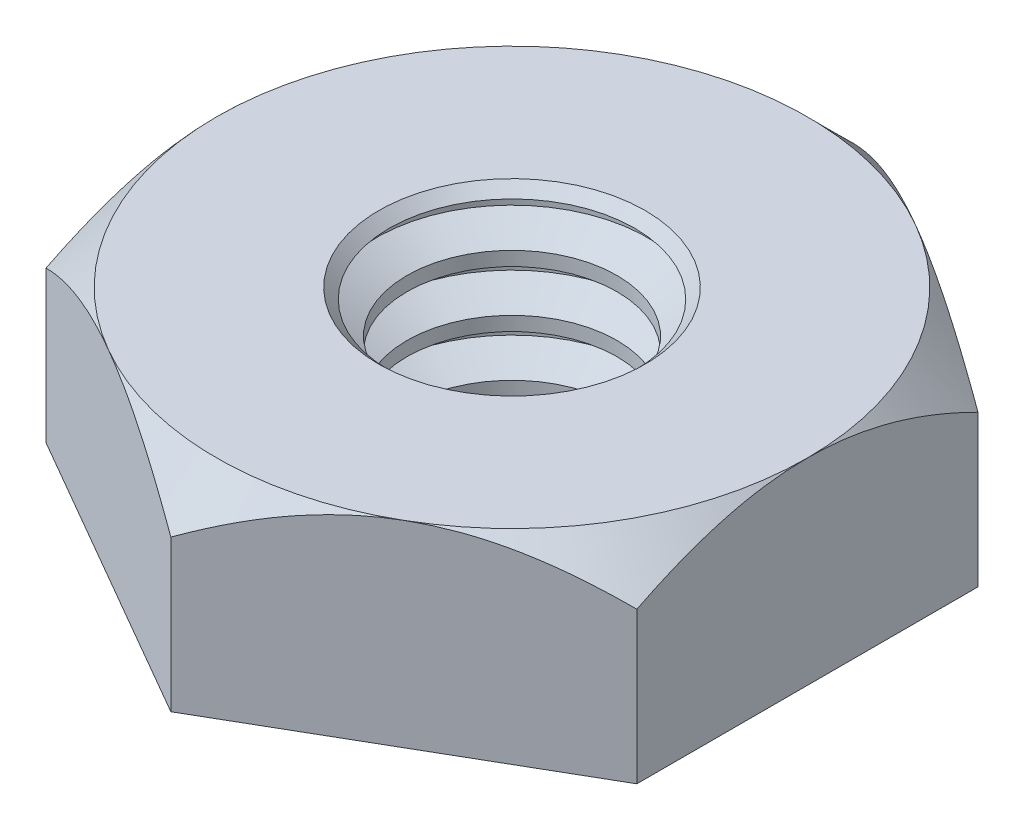
ISO-10303-21;
HEADER;
FILE_DESCRIPTION(('STEP AP214'),'2;1');
FILE_NAME('part.step','',(''),(''),'','','');
FILE_SCHEMA(('AUTOMOTIVE_DESIGN { 1 0 10303 214 1 1 1 1 }'));
ENDSEC;
DATA;
#1=APPLICATION_CONTEXT('core data for automotive mechanical design processes');
#2=APPLICATION_PROTOCOL_DEFINITION('international standard','automotive_design',2000,#1);
#3=PRODUCT_CONTEXT('',#1,'mechanical');
#4=PRODUCT('Part','Part','',(#3));
#5=PRODUCT_RELATED_PRODUCT_CATEGORY('part','',(#4));
#6=PRODUCT_DEFINITION_FORMATION('','',#4);
#7=PRODUCT_DEFINITION_CONTEXT('part definition',#1,'design');
#8=PRODUCT_DEFINITION('design','',#6,#7);
#9=PRODUCT_DEFINITION_SHAPE('','',#8);
#10=(LENGTH_UNIT() NAMED_UNIT(*) SI_UNIT(.MILLI.,.METRE.));
#11=(NAMED_UNIT(*) PLANE_ANGLE_UNIT() SI_UNIT($,.RADIAN.));
#12=(NAMED_UNIT(*) SI_UNIT($,.STERADIAN.) SOLID_ANGLE_UNIT());
#13=UNCERTAINTY_MEASURE_WITH_UNIT(LENGTH_MEASURE(1.E-05),#10,'distance_accuracy_value','');
#14=(GEOMETRIC_REPRESENTATION_CONTEXT(3) GLOBAL_UNCERTAINTY_ASSIGNED_CONTEXT((#13)) GLOBAL_UNIT_ASSIGNED_CONTEXT((#10,
#11,#12)) REPRESENTATION_CONTEXT('',''));
#15=CARTESIAN_POINT('',(0.,0.,0.));
#16=DIRECTION('',(0.,0.,1.));
#17=DIRECTION('',(1.,0.,0.));
#18=AXIS2_PLACEMENT_3D('',#15,#16,#17);
#19=CARTESIAN_POINT('',(0.,0.,-2.74963065701559));
#20=DIRECTION('',(0.,1.,0.));
#21=DIRECTION('',(0.,0.,1.));
#22=AXIS2_PLACEMENT_3D('',#19,#20,#21);
#23=PLANE('',#22);
#24=DIRECTION('',(-0.866025403784439,0.,-0.5));
#25=VECTOR('',#24,1.);
#26=CARTESIAN_POINT('',(2.38125,0.,-1.3748153285078));
#27=LINE('',#26,#25);
#28=CARTESIAN_POINT('',(2.38125,0.,-1.3748153285078));
#29=VERTEX_POINT('',#28);
#30=CARTESIAN_POINT('',(0.,0.,-2.74963065701559));
#31=VERTEX_POINT('',#30);
#32=EDGE_CURVE('E237',#29,#31,#27,.T.);
#33=ORIENTED_EDGE('',*,*,#32,.F.);
#34=DIRECTION('',(0.,0.,-1.));
#35=VECTOR('',#34,1.);
#36=CARTESIAN_POINT('',(2.38125,0.,1.3748153285078));
#37=LINE('',#36,#35);
#38=CARTESIAN_POINT('',(2.38125,0.,1.3748153285078));
#39=VERTEX_POINT('',#38);
#40=EDGE_CURVE('E326',#39,#29,#37,.T.);
#41=ORIENTED_EDGE('',*,*,#40,.F.);
#42=DIRECTION('',(0.866025403784439,0.,-0.5));
#43=VECTOR('',#42,1.);
#44=CARTESIAN_POINT('',(0.,0.,2.74963065701559));
#45=LINE('',#44,#43);
#46=CARTESIAN_POINT('',(0.,0.,2.74963065701559));
#47=VERTEX_POINT('',#46);
#48=EDGE_CURVE('E325',#47,#39,#45,.T.);
#49=ORIENTED_EDGE('',*,*,#48,.F.);
#50=DIRECTION('',(0.866025403784439,0.,0.5));
#51=VECTOR('',#50,1.);
#52=CARTESIAN_POINT('',(-2.38125,0.,1.3748153285078));
#53=LINE('',#52,#51);
#54=CARTESIAN_POINT('',(-2.38125,0.,1.3748153285078));
#55=VERTEX_POINT('',#54);
#56=EDGE_CURVE('E124',#55,#47,#53,.T.);
#57=ORIENTED_EDGE('',*,*,#56,.F.);
#58=DIRECTION('',(0.,0.,1.));
#59=VECTOR('',#58,1.);
#60=CARTESIAN_POINT('',(-2.38125,0.,-1.3748153285078));
#61=LINE('',#60,#59);
#62=CARTESIAN_POINT('',(-2.38125,0.,-1.3748153285078));
#63=VERTEX_POINT('',#62);
#64=EDGE_CURVE('E331',#63,#55,#61,.T.);
#65=ORIENTED_EDGE('',*,*,#64,.F.);
#66=DIRECTION('',(-0.866025403784439,0.,0.5));
#67=VECTOR('',#66,1.);
#68=CARTESIAN_POINT('',(0.,0.,-2.74963065701559));
#69=LINE('',#68,#67);
#70=EDGE_CURVE('E334',#31,#63,#69,.T.);
#71=ORIENTED_EDGE('',*,*,#70,.F.);
#72=EDGE_LOOP('',(#33,#41,#49,#57,#65,#71));
#73=FACE_BOUND('',#72,.T.);
#74=CARTESIAN_POINT('',(0.,0.,0.));
#75=DIRECTION('',(0.,1.,0.));
#76=DIRECTION('',(0.,0.,1.));
#77=AXIS2_PLACEMENT_3D('',#74,#75,#76);
#78=CIRCLE('',#77,1.04309945255329);
#79=CARTESIAN_POINT('',(0.,0.,1.04309945255329));
#80=VERTEX_POINT('',#79);
#81=EDGE_CURVE('E141',#80,#80,#78,.F.);
#82=ORIENTED_EDGE('',*,*,#81,.F.);
#83=EDGE_LOOP('',(#82));
#84=FACE_BOUND('',#83,.T.);
#85=ADVANCED_FACE('F30',(#73,#84),#23,.F.);
#86=CARTESIAN_POINT('',(0.,1.5875,-2.74963065701559));
#87=DIRECTION('',(0.,1.,0.));
#88=DIRECTION('',(0.,0.,1.));
#89=AXIS2_PLACEMENT_3D('',#86,#87,#88);
#90=PLANE('',#89);
#91=CARTESIAN_POINT('',(0.,1.5875,0.));
#92=DIRECTION('',(0.,1.,0.));
#93=DIRECTION('',(0.,0.,1.));
#94=AXIS2_PLACEMENT_3D('',#91,#92,#93);
#95=CIRCLE('',#94,1.07348297705218);
#96=CARTESIAN_POINT('',(0.,1.5875,1.07348297705218));
#97=VERTEX_POINT('',#96);
#98=EDGE_CURVE('E11',#97,#97,#95,.F.);
#99=ORIENTED_EDGE('',*,*,#98,.T.);
#100=EDGE_LOOP('',(#99));
#101=FACE_BOUND('',#100,.T.);
#102=CARTESIAN_POINT('',(0.,1.5875,0.));
#103=DIRECTION('',(0.,1.,0.));
#104=DIRECTION('',(0.,0.,1.));
#105=AXIS2_PLACEMENT_3D('',#102,#103,#104);
#106=CIRCLE('',#105,2.38125);
#107=CARTESIAN_POINT('',(-1.190625,1.5875,2.06222299276169));
#108=VERTEX_POINT('',#107);
#109=CARTESIAN_POINT('',(1.190625,1.5875,2.06222299276169));
#110=VERTEX_POINT('',#109);
#111=EDGE_CURVE('E106',#108,#110,#106,.T.);
#112=ORIENTED_EDGE('',*,*,#111,.T.);
#113=CARTESIAN_POINT('',(0.,1.5875,0.));
#114=DIRECTION('',(0.,1.,0.));
#115=DIRECTION('',(0.,0.,1.));
#116=AXIS2_PLACEMENT_3D('',#113,#114,#115);
#117=CIRCLE('',#116,2.38125);
#118=CARTESIAN_POINT('',(2.38125,1.5875,0.));
#119=VERTEX_POINT('',#118);
#120=EDGE_CURVE('E46',#110,#119,#117,.T.);
#121=ORIENTED_EDGE('',*,*,#120,.T.);
#122=CARTESIAN_POINT('',(1.190625,1.5875,-2.06222299276169));
#123=VERTEX_POINT('',#122);
#124=EDGE_CURVE('E140',#119,#123,#106,.T.);
#125=ORIENTED_EDGE('',*,*,#124,.T.);
#126=CARTESIAN_POINT('',(-1.190625,1.5875,-2.06222299276169));
#127=VERTEX_POINT('',#126);
#128=EDGE_CURVE('E148',#123,#127,#106,.T.);
#129=ORIENTED_EDGE('',*,*,#128,.T.);
#130=CARTESIAN_POINT('',(-2.38125,1.5875,0.));
#131=VERTEX_POINT('',#130);
#132=EDGE_CURVE('E151',#127,#131,#106,.T.);
#133=ORIENTED_EDGE('',*,*,#132,.T.);
#134=EDGE_CURVE('E139',#131,#108,#106,.T.);
#135=ORIENTED_EDGE('',*,*,#134,.T.);
#136=EDGE_LOOP('',(#112,#121,#125,#129,#133,#135));
#137=FACE_BOUND('',#136,.T.);
#138=ADVANCED_FACE('F158',(#101,#137),#90,.T.);
#139=CARTESIAN_POINT('',(2.38125,1.5875,-1.3748153285078));
#140=DIRECTION('',(-0.5,0.,0.866025403784439));
#141=DIRECTION('',(0.866025403784439,0.,0.5));
#142=AXIS2_PLACEMENT_3D('',#139,#140,#141);
#143=PLANE('',#142);
#144=CARTESIAN_POINT('',(2.38145,1.21900386565717,-1.37469985845396));
#145=CARTESIAN_POINT('',(2.29959321762095,1.26622444627488,-1.4219598937955));
#146=CARTESIAN_POINT('',(2.21636766622824,1.31067176769151,-1.47001018829554));
#147=CARTESIAN_POINT('',(2.04666151916196,1.39205388599883,-1.56799007798739));
#148=CARTESIAN_POINT('',(1.9601647826469,1.42894339988927,-1.61792899209838));
#149=CARTESIAN_POINT('',(1.78574822599095,1.4921359298185,-1.71862843803482));
#150=CARTESIAN_POINT('',(1.69787282881932,1.51859778425493,-1.76936332224701));
#151=CARTESIAN_POINT('',(1.52018740592912,1.55936782736835,-1.87195004898374));
#152=CARTESIAN_POINT('',(1.43038280881412,1.57370645145386,-1.92379875730255));
#153=CARTESIAN_POINT('',(1.27561039686965,1.58664355821429,-2.01315665100181));
#154=CARTESIAN_POINT('',(1.21084255103038,1.58855873833123,-2.05055038423195));
#155=CARTESIAN_POINT('',(1.08141272066442,1.58533272021673,-2.12527673163491));
#156=CARTESIAN_POINT('',(1.01675078120663,1.58018904812732,-2.16260931978718));
#157=CARTESIAN_POINT('',(0.888037451422592,1.56313803211277,-2.23692199538629));
#158=CARTESIAN_POINT('',(0.823986825765134,1.55122312163507,-2.27390164135139));
#159=CARTESIAN_POINT('',(0.696993161094713,1.52128367063237,-2.34722146783423));
#160=CARTESIAN_POINT('',(0.634050037564162,1.50325959846595,-2.38356169714823));
#161=CARTESIAN_POINT('',(0.472823849267806,1.44975053543199,-2.47664568036155));
#162=CARTESIAN_POINT('',(0.375540508712151,1.41023192211222,-2.53281224321902));
#163=CARTESIAN_POINT('',(0.232493937374424,1.34351899943361,-2.61540021968751));
#164=CARTESIAN_POINT('',(0.185353711056031,1.32007913387307,-2.6426166420421));
#165=CARTESIAN_POINT('',(0.0919464736333593,1.27106266632487,-2.69654533571234));
#166=CARTESIAN_POINT('',(0.045678947503177,1.24548737621756,-2.72325790437834));
#167=CARTESIAN_POINT('',(-0.000200000000000699,1.21900386565717,-2.74974612706943));
#168=B_SPLINE_CURVE_WITH_KNOTS('',3,(#144,#145,#146,#147,#148,#149,#150,#151,#152,#153,#154,
#155,#156,#157,#158,#159,#160,#161,#162,#163,#164,#165,#166,#167),.UNSPECIFIED.,.F.,.F.,(4,2,2,
2,2,2,2,2,2,2,2,4),(0.,0.317196610611951,0.636241461041222,0.950218950629226,1.26340583824127,
1.48752413747845,1.71172100167748,1.93616888974083,2.16059957440838,2.51709639744764,
2.69486147369099,2.87251813383154),.UNSPECIFIED.);
#169=CARTESIAN_POINT('',(2.38125,1.21911934298441,-1.3748153285078));
#170=VERTEX_POINT('',#169);
#171=EDGE_CURVE('E336',#170,#123,#168,.T.);
#172=ORIENTED_EDGE('',*,*,#171,.F.);
#173=DIRECTION('',(0.,-1.,0.));
#174=VECTOR('',#173,1.);
#175=CARTESIAN_POINT('',(2.38125,1.5875,-1.3748153285078));
#176=LINE('',#175,#174);
#177=EDGE_CURVE('E131',#170,#29,#176,.T.);
#178=ORIENTED_EDGE('',*,*,#177,.T.);
#179=ORIENTED_EDGE('',*,*,#32,.T.);
#180=DIRECTION('',(0.,-1.,0.));
#181=VECTOR('',#180,1.);
#182=CARTESIAN_POINT('',(0.,1.5875,-2.74963065701559));
#183=LINE('',#182,#181);
#184=CARTESIAN_POINT('',(0.,1.21911934298441,-2.74963065701559));
#185=VERTEX_POINT('',#184);
#186=EDGE_CURVE('E136',#185,#31,#183,.T.);
#187=ORIENTED_EDGE('',*,*,#186,.F.);
#188=EDGE_CURVE('E209',#123,#185,#168,.T.);
#189=ORIENTED_EDGE('',*,*,#188,.F.);
#190=EDGE_LOOP('',(#172,#178,#179,#187,#189));
#191=FACE_BOUND('',#190,.T.);
#192=ADVANCED_FACE('F32',(#191),#143,.F.);
#193=CARTESIAN_POINT('',(0.,1.5875,-2.74963065701559));
#194=DIRECTION('',(0.5,0.,0.866025403784439));
#195=DIRECTION('',(0.866025403784439,0.,-0.5));
#196=AXIS2_PLACEMENT_3D('',#193,#194,#195);
#197=PLANE('',#196);
#198=CARTESIAN_POINT('',(0.000199999999999588,1.21900386565717,-2.74974612706943));
#199=CARTESIAN_POINT('',(-0.0816567823790513,1.26622444627487,-2.70248609172789));
#200=CARTESIAN_POINT('',(-0.164882333771762,1.31067176769151,-2.65443579722785));
#201=CARTESIAN_POINT('',(-0.334588480838042,1.39205388599883,-2.556455907536));
#202=CARTESIAN_POINT('',(-0.421085217353105,1.42894339988927,-2.50651699342501));
#203=CARTESIAN_POINT('',(-0.595501774009046,1.4921359298185,-2.40581754748857));
#204=CARTESIAN_POINT('',(-0.683377171180679,1.51859778425493,-2.35508266327638));
#205=CARTESIAN_POINT('',(-0.861062594070881,1.55936782736835,-2.25249593653965));
#206=CARTESIAN_POINT('',(-0.950867191185877,1.57370645145386,-2.20064722822084));
#207=CARTESIAN_POINT('',(-1.10563960313035,1.58664355821429,-2.11128933452158));
#208=CARTESIAN_POINT('',(-1.17040744896963,1.58855873833123,-2.07389560129144));
#209=CARTESIAN_POINT('',(-1.29983727933558,1.58533272021672,-1.99916925388848));
#210=CARTESIAN_POINT('',(-1.36449921879337,1.58018904812732,-1.96183666573621));
#211=CARTESIAN_POINT('',(-1.49321254857741,1.56313803211277,-1.8875239901371));
#212=CARTESIAN_POINT('',(-1.55726317423487,1.55122312163507,-1.850544344172));
#213=CARTESIAN_POINT('',(-1.68425683890529,1.52128367063237,-1.77722451768916));
#214=CARTESIAN_POINT('',(-1.74719996243584,1.50325959846595,-1.74088428837516));
#215=CARTESIAN_POINT('',(-1.90842615073219,1.44975053543199,-1.64780030516184));
#216=CARTESIAN_POINT('',(-2.00570949128785,1.41023192211222,-1.59163374230437));
#217=CARTESIAN_POINT('',(-2.14875606262558,1.34351899943361,-1.50904576583588));
#218=CARTESIAN_POINT('',(-2.19589628894397,1.32007913387307,-1.48182934348129));
#219=CARTESIAN_POINT('',(-2.28930352636664,1.27106266632487,-1.42790064981105));
#220=CARTESIAN_POINT('',(-2.33557105249682,1.24548737621756,-1.40118808114506));
#221=CARTESIAN_POINT('',(-2.38145,1.21900386565717,-1.37469985845396));
#222=B_SPLINE_CURVE_WITH_KNOTS('',3,(#198,#199,#200,#201,#202,#203,#204,#205,#206,#207,#208,
#209,#210,#211,#212,#213,#214,#215,#216,#217,#218,#219,#220,#221),.UNSPECIFIED.,.F.,.F.,(4,2,2,
2,2,2,2,2,2,2,2,4),(0.,0.31719661061195,0.636241461041221,0.950218950629226,1.26340583824127,
1.48752413747845,1.71172100167748,1.93616888974083,2.16059957440838,2.51709639744763,
2.69486147369099,2.87251813383154),.UNSPECIFIED.);
#223=EDGE_CURVE('E208',#185,#127,#222,.T.);
#224=ORIENTED_EDGE('',*,*,#223,.F.);
#225=ORIENTED_EDGE('',*,*,#186,.T.);
#226=ORIENTED_EDGE('',*,*,#70,.T.);
#227=DIRECTION('',(0.,-1.,0.));
#228=VECTOR('',#227,1.);
#229=CARTESIAN_POINT('',(-2.38125,1.5875,-1.3748153285078));
#230=LINE('',#229,#228);
#231=CARTESIAN_POINT('',(-2.38125,1.21911934298441,-1.3748153285078));
#232=VERTEX_POINT('',#231);
#233=EDGE_CURVE('E129',#232,#63,#230,.T.);
#234=ORIENTED_EDGE('',*,*,#233,.F.);
#235=EDGE_CURVE('E204',#127,#232,#222,.T.);
#236=ORIENTED_EDGE('',*,*,#235,.F.);
#237=EDGE_LOOP('',(#224,#225,#226,#234,#236));
#238=FACE_BOUND('',#237,.T.);
#239=ADVANCED_FACE('F214',(#238),#197,.F.);
#240=CARTESIAN_POINT('',(-2.38125,1.5875,-1.3748153285078));
#241=DIRECTION('',(1.,0.,0.));
#242=DIRECTION('',(0.,0.,-1.));
#243=AXIS2_PLACEMENT_3D('',#240,#241,#242);
#244=PLANE('',#243);
#245=CARTESIAN_POINT('',(-2.38125,0.240179588906191,-2.86912630394418));
#246=CARTESIAN_POINT('',(-2.38125,0.29350668912669,-2.79980955592459));
#247=CARTESIAN_POINT('',(-2.38125,0.346355938633454,-2.73011931645309));
#248=CARTESIAN_POINT('',(-2.38125,0.45088042407572,-2.5898391961498));
#249=CARTESIAN_POINT('',(-2.38125,0.502555379296205,-2.519249106375));
#250=CARTESIAN_POINT('',(-2.38125,0.604880705975397,-2.37650077502421));
#251=CARTESIAN_POINT('',(-2.38125,0.655520097364179,-2.30433463685782));
#252=CARTESIAN_POINT('',(-2.38125,0.755036614291819,-2.15880130547658));
#253=CARTESIAN_POINT('',(-2.38125,0.803913861173318,-2.08543419546941));
#254=CARTESIAN_POINT('',(-2.38125,0.902542961805662,-1.93258845780626));
#255=CARTESIAN_POINT('',(-2.38125,0.952152910200811,-1.85301779850508));
#256=CARTESIAN_POINT('',(-2.38125,1.04827866709485,-1.69203159559178));
#257=CARTESIAN_POINT('',(-2.38125,1.09479487864361,-1.61061629415845));
#258=CARTESIAN_POINT('',(-2.38125,1.18376557525143,-1.44588343133112));
#259=CARTESIAN_POINT('',(-2.38125,1.22623141970181,-1.36257205340724));
#260=CARTESIAN_POINT('',(-2.38125,1.30614212570997,-1.19359416640858));
#261=CARTESIAN_POINT('',(-2.38125,1.34358935588908,-1.10792879151244));
#262=CARTESIAN_POINT('',(-2.38125,1.40872452306873,-0.942635039086761));
#263=CARTESIAN_POINT('',(-2.38125,1.43701080014171,-0.863244863476224));
#264=CARTESIAN_POINT('',(-2.38125,1.48722865765993,-0.702441892782961));
#265=CARTESIAN_POINT('',(-2.38125,1.50915983334739,-0.621028969229361));
#266=CARTESIAN_POINT('',(-2.38125,1.54511481952273,-0.458084644425683));
#267=CARTESIAN_POINT('',(-2.38125,1.55928224783569,-0.376585475437999));
#268=CARTESIAN_POINT('',(-2.38125,1.57941416514849,-0.212574622282759));
#269=CARTESIAN_POINT('',(-2.38125,1.5853803560254,-0.130063151769297));
#270=CARTESIAN_POINT('',(-2.38125,1.58860164225672,0.0315222598582071));
#271=CARTESIAN_POINT('',(-2.38125,1.58622590278112,0.110588903174691));
#272=CARTESIAN_POINT('',(-2.38125,1.5737417806567,0.268104622589962));
#273=CARTESIAN_POINT('',(-2.38125,1.56363269564102,0.346553641940322));
#274=CARTESIAN_POINT('',(-2.38125,1.53608239112472,0.503598587723649));
#275=CARTESIAN_POINT('',(-2.38125,1.51851172190117,0.582171453187213));
#276=CARTESIAN_POINT('',(-2.38125,1.47701024838173,0.737578750449081));
#277=CARTESIAN_POINT('',(-2.38125,1.45307980531335,0.814413280713858));
#278=CARTESIAN_POINT('',(-2.38125,1.37028997046201,1.05086897592276));
#279=CARTESIAN_POINT('',(-2.38125,1.30223450438981,1.20728049738153));
#280=CARTESIAN_POINT('',(-2.38125,1.18870821735986,1.43619844948697));
#281=CARTESIAN_POINT('',(-2.38125,1.14887086566416,1.51169480576284));
#282=CARTESIAN_POINT('',(-2.38125,1.0661066438325,1.6609787360797));
#283=CARTESIAN_POINT('',(-2.38125,1.02318031702828,1.73476660762932));
#284=CARTESIAN_POINT('',(-2.38125,0.937038433864164,1.87722638325708));
#285=CARTESIAN_POINT('',(-2.38125,0.893941790031279,1.94597101003489));
#286=CARTESIAN_POINT('',(-2.38125,0.805912978151156,2.08228069367818));
#287=CARTESIAN_POINT('',(-2.38125,0.760980672486614,2.14984566156212));
#288=CARTESIAN_POINT('',(-2.38125,0.669974823916357,2.2834054266231));
#289=CARTESIAN_POINT('',(-2.38125,0.623913340345271,2.34940847508033));
#290=CARTESIAN_POINT('',(-2.38125,0.530555625753051,2.48050909903297));
#291=CARTESIAN_POINT('',(-2.38125,0.483259738608899,2.54560691911997));
#292=CARTESIAN_POINT('',(-2.38125,0.43545844514295,2.61032519987917));
#293=B_SPLINE_CURVE_WITH_KNOTS('',3,(#245,#246,#247,#248,#249,#250,#251,#252,#253,#254,#255,
#256,#257,#258,#259,#260,#261,#262,#263,#264,#265,#266,#267,#268,#269,#270,#271,#272,#273,#274,
#275,#276,#277,#278,#279,#280,#281,#282,#283,#284,#285,#286,#287,#288,#289,#290,#291,#292),
.UNSPECIFIED.,.F.,.F.,(4,2,2,2,2,2,2,2,2,2,2,2,2,2,2,2,2,2,2,2,2,2,2,4),(0.,0.262373486076588,
0.524809046422165,0.789269246638216,1.05371120100017,1.33496294182564,1.61617796930575,
1.89657958024649,2.17684838122957,2.42946682102385,2.68210134660698,2.92988953986811,
3.1776263056777,3.41454048769347,3.65147618955808,3.89270212574337,4.13391436351257,
4.64406226241703,4.90012722407797,5.15614725506487,5.3995273075234,5.64292563948721,
5.88436975409122,6.12574731099198),.UNSPECIFIED.);
#294=EDGE_CURVE('E163',#232,#131,#293,.T.);
#295=ORIENTED_EDGE('',*,*,#294,.F.);
#296=ORIENTED_EDGE('',*,*,#233,.T.);
#297=ORIENTED_EDGE('',*,*,#64,.T.);
#298=DIRECTION('',(0.,-1.,0.));
#299=VECTOR('',#298,1.);
#300=CARTESIAN_POINT('',(-2.38125,1.5875,1.3748153285078));
#301=LINE('',#300,#299);
#302=CARTESIAN_POINT('',(-2.38125,1.21911934298441,1.3748153285078));
#303=VERTEX_POINT('',#302);
#304=EDGE_CURVE('E126',#303,#55,#301,.T.);
#305=ORIENTED_EDGE('',*,*,#304,.F.);
#306=EDGE_CURVE('E161',#131,#303,#293,.T.);
#307=ORIENTED_EDGE('',*,*,#306,.F.);
#308=EDGE_LOOP('',(#295,#296,#297,#305,#307));
#309=FACE_BOUND('',#308,.T.);
#310=ADVANCED_FACE('F217',(#309),#244,.F.);
#311=CARTESIAN_POINT('',(-2.38125,1.5875,1.3748153285078));
#312=DIRECTION('',(0.5,0.,-0.866025403784439));
#313=DIRECTION('',(-0.866025403784439,0.,-0.5));
#314=AXIS2_PLACEMENT_3D('',#311,#312,#313);
#315=PLANE('',#314);
#316=CARTESIAN_POINT('',(-2.38145,1.21900386565718,1.37469985845396));
#317=CARTESIAN_POINT('',(-2.29959321762095,1.26622444627488,1.4219598937955));
#318=CARTESIAN_POINT('',(-2.21636766622824,1.31067176769151,1.47001018829554));
#319=CARTESIAN_POINT('',(-2.04666151916196,1.39205388599883,1.56799007798739));
#320=CARTESIAN_POINT('',(-1.96016478264689,1.42894339988927,1.61792899209838));
#321=CARTESIAN_POINT('',(-1.78574822599095,1.4921359298185,1.71862843803482));
#322=CARTESIAN_POINT('',(-1.69787282881932,1.51859778425493,1.76936332224701));
#323=CARTESIAN_POINT('',(-1.52018740592912,1.55936782736835,1.87195004898374));
#324=CARTESIAN_POINT('',(-1.43038280881412,1.57370645145386,1.92379875730254));
#325=CARTESIAN_POINT('',(-1.27561039686965,1.58664355821429,2.01315665100181));
#326=CARTESIAN_POINT('',(-1.21084255103037,1.58855873833123,2.05055038423195));
#327=CARTESIAN_POINT('',(-1.08141272066442,1.58533272021672,2.12527673163491));
#328=CARTESIAN_POINT('',(-1.01675078120663,1.58018904812732,2.16260931978718));
#329=CARTESIAN_POINT('',(-0.888037451422592,1.56313803211277,2.23692199538629));
#330=CARTESIAN_POINT('',(-0.823986825765134,1.55122312163507,2.27390164135139));
#331=CARTESIAN_POINT('',(-0.696993161094713,1.52128367063237,2.34722146783423));
#332=CARTESIAN_POINT('',(-0.634050037564162,1.50325959846595,2.38356169714823));
#333=CARTESIAN_POINT('',(-0.472823849267806,1.449750535432,2.47664568036155));
#334=CARTESIAN_POINT('',(-0.375540508712151,1.41023192211223,2.53281224321902));
#335=CARTESIAN_POINT('',(-0.232493937374424,1.34351899943361,2.61540021968751));
#336=CARTESIAN_POINT('',(-0.185353711056031,1.32007913387307,2.6426166420421));
#337=CARTESIAN_POINT('',(-0.0919464736333589,1.27106266632487,2.69654533571234));
#338=CARTESIAN_POINT('',(-0.0456789475031766,1.24548737621756,2.72325790437833));
#339=CARTESIAN_POINT('',(0.000200000000000871,1.21900386565717,2.74974612706943));
#340=B_SPLINE_CURVE_WITH_KNOTS('',3,(#316,#317,#318,#319,#320,#321,#322,#323,#324,#325,#326,
#327,#328,#329,#330,#331,#332,#333,#334,#335,#336,#337,#338,#339),.UNSPECIFIED.,.F.,.F.,(4,2,2,
2,2,2,2,2,2,2,2,4),(0.,0.31719661061195,0.636241461041222,0.950218950629227,1.26340583824127,
1.48752413747845,1.71172100167748,1.93616888974083,2.16059957440838,2.51709639744763,
2.69486147369099,2.87251813383154),.UNSPECIFIED.);
#341=EDGE_CURVE('E111',#303,#108,#340,.T.);
#342=ORIENTED_EDGE('',*,*,#341,.F.);
#343=ORIENTED_EDGE('',*,*,#304,.T.);
#344=ORIENTED_EDGE('',*,*,#56,.T.);
#345=DIRECTION('',(0.,-1.,0.));
#346=VECTOR('',#345,1.);
#347=CARTESIAN_POINT('',(0.,1.5875,2.74963065701559));
#348=LINE('',#347,#346);
#349=CARTESIAN_POINT('',(0.,1.21911934298441,2.74963065701559));
#350=VERTEX_POINT('',#349);
#351=EDGE_CURVE('E117',#350,#47,#348,.T.);
#352=ORIENTED_EDGE('',*,*,#351,.F.);
#353=EDGE_CURVE('E102',#108,#350,#340,.T.);
#354=ORIENTED_EDGE('',*,*,#353,.F.);
#355=EDGE_LOOP('',(#342,#343,#344,#352,#354));
#356=FACE_BOUND('',#355,.T.);
#357=ADVANCED_FACE('F122',(#356),#315,.F.);
#358=CARTESIAN_POINT('',(0.,1.5875,2.74963065701559));
#359=DIRECTION('',(-0.5,0.,-0.866025403784439));
#360=DIRECTION('',(-0.866025403784439,0.,0.5));
#361=AXIS2_PLACEMENT_3D('',#358,#359,#360);
#362=PLANE('',#361);
#363=CARTESIAN_POINT('',(-0.00019999999999946,1.21900386565717,2.74974612706943));
#364=CARTESIAN_POINT('',(0.0816567823790512,1.26622444627487,2.70248609172789));
#365=CARTESIAN_POINT('',(0.164882333771762,1.31067176769151,2.65443579722785));
#366=CARTESIAN_POINT('',(0.334588480838042,1.39205388599883,2.556455907536));
#367=CARTESIAN_POINT('',(0.421085217353105,1.42894339988927,2.50651699342501));
#368=CARTESIAN_POINT('',(0.595501774009046,1.4921359298185,2.40581754748857));
#369=CARTESIAN_POINT('',(0.683377171180679,1.51859778425493,2.35508266327638));
#370=CARTESIAN_POINT('',(0.86106259407088,1.55936782736835,2.25249593653965));
#371=CARTESIAN_POINT('',(0.950867191185876,1.57370645145386,2.20064722822084));
#372=CARTESIAN_POINT('',(1.10563960313035,1.58664355821429,2.11128933452158));
#373=CARTESIAN_POINT('',(1.17040744896962,1.58855873833122,2.07389560129144));
#374=CARTESIAN_POINT('',(1.29983727933558,1.58533272021672,1.99916925388848));
#375=CARTESIAN_POINT('',(1.36449921879337,1.58018904812732,1.96183666573621));
#376=CARTESIAN_POINT('',(1.49321254857741,1.56313803211277,1.8875239901371));
#377=CARTESIAN_POINT('',(1.55726317423487,1.55122312163507,1.850544344172));
#378=CARTESIAN_POINT('',(1.68425683890529,1.52128367063237,1.77722451768916));
#379=CARTESIAN_POINT('',(1.74719996243584,1.50325959846595,1.74088428837516));
#380=CARTESIAN_POINT('',(1.90842615073219,1.44975053543199,1.64780030516184));
#381=CARTESIAN_POINT('',(2.00570949128785,1.41023192211222,1.59163374230437));
#382=CARTESIAN_POINT('',(2.14875606262558,1.34351899943361,1.50904576583588));
#383=CARTESIAN_POINT('',(2.19589628894397,1.32007913387307,1.48182934348129));
#384=CARTESIAN_POINT('',(2.28930352636664,1.27106266632487,1.42790064981105));
#385=CARTESIAN_POINT('',(2.33557105249682,1.24548737621756,1.40118808114505));
#386=CARTESIAN_POINT('',(2.38145,1.21900386565717,1.37469985845396));
#387=B_SPLINE_CURVE_WITH_KNOTS('',3,(#363,#364,#365,#366,#367,#368,#369,#370,#371,#372,#373,
#374,#375,#376,#377,#378,#379,#380,#381,#382,#383,#384,#385,#386),.UNSPECIFIED.,.F.,.F.,(4,2,2,
2,2,2,2,2,2,2,2,4),(0.,0.31719661061195,0.63624146104122,0.950218950629225,1.26340583824126,
1.48752413747845,1.71172100167748,1.93616888974083,2.16059957440838,2.51709639744763,
2.69486147369099,2.87251813383154),.UNSPECIFIED.);
#388=EDGE_CURVE('E105',#350,#110,#387,.T.);
#389=ORIENTED_EDGE('',*,*,#388,.F.);
#390=ORIENTED_EDGE('',*,*,#351,.T.);
#391=ORIENTED_EDGE('',*,*,#48,.T.);
#392=DIRECTION('',(0.,-1.,0.));
#393=VECTOR('',#392,1.);
#394=CARTESIAN_POINT('',(2.38125,1.5875,1.3748153285078));
#395=LINE('',#394,#393);
#396=CARTESIAN_POINT('',(2.38125,1.21911934298441,1.3748153285078));
#397=VERTEX_POINT('',#396);
#398=EDGE_CURVE('E127',#397,#39,#395,.T.);
#399=ORIENTED_EDGE('',*,*,#398,.F.);
#400=EDGE_CURVE('E120',#110,#397,#387,.T.);
#401=ORIENTED_EDGE('',*,*,#400,.F.);
#402=EDGE_LOOP('',(#389,#390,#391,#399,#401));
#403=FACE_BOUND('',#402,.T.);
#404=ADVANCED_FACE('F115',(#403),#362,.F.);
#405=CARTESIAN_POINT('',(2.38125,1.5875,1.3748153285078));
#406=DIRECTION('',(-1.,0.,0.));
#407=DIRECTION('',(0.,0.,1.));
#408=AXIS2_PLACEMENT_3D('',#405,#406,#407);
#409=PLANE('',#408);
#410=CARTESIAN_POINT('',(2.38125,0.240179588902674,-2.86912630394875));
#411=CARTESIAN_POINT('',(2.38125,0.29350668912328,-2.79980955592907));
#412=CARTESIAN_POINT('',(2.38125,0.346355938630151,-2.73011931645747));
#413=CARTESIAN_POINT('',(2.38125,0.450880424072634,-2.589839196154));
#414=CARTESIAN_POINT('',(2.38125,0.502555379293228,-2.5192491063791));
#415=CARTESIAN_POINT('',(2.38125,0.604880705972639,-2.37650077502812));
#416=CARTESIAN_POINT('',(2.38125,0.65552009736153,-2.30433463686163));
#417=CARTESIAN_POINT('',(2.38125,0.755036614289391,-2.15880130548019));
#418=CARTESIAN_POINT('',(2.38125,0.803913861171,-2.08543419547292));
#419=CARTESIAN_POINT('',(2.38125,0.902542961803583,-1.93258845780956));
#420=CARTESIAN_POINT('',(2.38125,0.95215291019886,-1.85301779850826));
#421=CARTESIAN_POINT('',(2.38125,1.04827866709316,-1.69203159559471));
#422=CARTESIAN_POINT('',(2.38125,1.09479487864204,-1.61061629416126));
#423=CARTESIAN_POINT('',(2.38125,1.18376557525011,-1.44588343133367));
#424=CARTESIAN_POINT('',(2.38125,1.22623141970061,-1.36257205340966));
#425=CARTESIAN_POINT('',(2.38125,1.306142125709,-1.19359416641074));
#426=CARTESIAN_POINT('',(2.38125,1.34358935588823,-1.10792879151447));
#427=CARTESIAN_POINT('',(2.38125,1.40872452306806,-0.942635039088584));
#428=CARTESIAN_POINT('',(2.38125,1.43701080014111,-0.863244863477981));
#429=CARTESIAN_POINT('',(2.38125,1.48722865765948,-0.702441892784583));
#430=CARTESIAN_POINT('',(2.38125,1.509159833347,-0.621028969230913));
#431=CARTESIAN_POINT('',(2.38125,1.54511481952247,-0.458084644427093));
#432=CARTESIAN_POINT('',(2.38125,1.55928224783549,-0.376585475439337));
#433=CARTESIAN_POINT('',(2.38125,1.57941416514839,-0.212574622283949));
#434=CARTESIAN_POINT('',(2.38125,1.58538035602535,-0.13006315177041));
#435=CARTESIAN_POINT('',(2.38125,1.58860164225673,0.0315222598572311));
#436=CARTESIAN_POINT('',(2.38125,1.58622590278117,0.110588903173773));
#437=CARTESIAN_POINT('',(2.38125,1.57374178065679,0.268104622589163));
#438=CARTESIAN_POINT('',(2.38125,1.56363269564113,0.346553641939584));
#439=CARTESIAN_POINT('',(2.38125,1.53608239112485,0.503598587723034));
#440=CARTESIAN_POINT('',(2.38125,1.5185117219013,0.58217145318666));
#441=CARTESIAN_POINT('',(2.38125,1.47701024838186,0.737578750448652));
#442=CARTESIAN_POINT('',(2.38125,1.45307980531348,0.814413280713489));
#443=CARTESIAN_POINT('',(2.38125,1.37028997046216,1.05086897592239));
#444=CARTESIAN_POINT('',(2.38125,1.30223450439,1.20728049738111));
#445=CARTESIAN_POINT('',(2.38125,1.18870821736013,1.43619844948646));
#446=CARTESIAN_POINT('',(2.38125,1.14887086566444,1.51169480576231));
#447=CARTESIAN_POINT('',(2.38125,1.06610664383284,1.66097873607911));
#448=CARTESIAN_POINT('',(2.38125,1.02318031702864,1.73476660762871));
#449=CARTESIAN_POINT('',(2.38125,0.937038433864573,1.87722638325642));
#450=CARTESIAN_POINT('',(2.38125,0.893941790031711,1.94597101003421));
#451=CARTESIAN_POINT('',(2.38125,0.805912978151634,2.08228069367746));
#452=CARTESIAN_POINT('',(2.38125,0.760980672487116,2.14984566156137));
#453=CARTESIAN_POINT('',(2.38125,0.669974823916905,2.28340542662231));
#454=CARTESIAN_POINT('',(2.38125,0.623913340345843,2.34940847507952));
#455=CARTESIAN_POINT('',(2.38125,0.530555625753669,2.48050909903211));
#456=CARTESIAN_POINT('',(2.38125,0.483259738609541,2.54560691911909));
#457=CARTESIAN_POINT('',(2.38125,0.435458445143615,2.61032519987827));
#458=B_SPLINE_CURVE_WITH_KNOTS('',3,(#410,#411,#412,#413,#414,#415,#416,#417,#418,#419,#420,
#421,#422,#423,#424,#425,#426,#427,#428,#429,#430,#431,#432,#433,#434,#435,#436,#437,#438,#439,
#440,#441,#442,#443,#444,#445,#446,#447,#448,#449,#450,#451,#452,#453,#454,#455,#456,#457),
.UNSPECIFIED.,.F.,.F.,(4,2,2,2,2,2,2,2,2,2,2,2,2,2,2,2,2,2,2,2,2,2,2,4),(0.,0.26237348607701,
0.52480904642301,0.789269246639487,1.05371120100187,1.33496294182785,1.61617796930847,
1.89657958024972,2.17684838123331,2.42946682102785,2.68210134661124,2.92988953987261,
3.17762630568243,3.41454048769837,3.65147618956316,3.89270212574863,4.13391436351801,
4.64406226242227,4.9001272240831,5.1561472550699,5.39952730752833,5.64292563949204,
5.88436975409596,6.12574731099663),.UNSPECIFIED.);
#459=EDGE_CURVE('E317',#397,#119,#458,.F.);
#460=ORIENTED_EDGE('',*,*,#459,.F.);
#461=ORIENTED_EDGE('',*,*,#398,.T.);
#462=ORIENTED_EDGE('',*,*,#40,.T.);
#463=ORIENTED_EDGE('',*,*,#177,.F.);
#464=EDGE_CURVE('E194',#119,#170,#458,.F.);
#465=ORIENTED_EDGE('',*,*,#464,.F.);
#466=EDGE_LOOP('',(#460,#461,#462,#463,#465));
#467=FACE_BOUND('',#466,.T.);
#468=ADVANCED_FACE('F322',(#467),#409,.F.);
#469=CARTESIAN_POINT('',(0.,1.5875,0.));
#470=DIRECTION('',(0.,-1.,0.));
#471=DIRECTION('',(0.,0.,-1.));
#472=AXIS2_PLACEMENT_3D('',#469,#470,#471);
#473=CONICAL_SURFACE('',#472,2.38125,0.785398163397455);
#474=ORIENTED_EDGE('',*,*,#353,.T.);
#475=ORIENTED_EDGE('',*,*,#388,.T.);
#476=ORIENTED_EDGE('',*,*,#111,.F.);
#477=EDGE_LOOP('',(#474,#475,#476));
#478=FACE_BOUND('',#477,.T.);
#479=ADVANCED_FACE('F104',(#478),#473,.T.);
#480=ORIENTED_EDGE('',*,*,#306,.T.);
#481=ORIENTED_EDGE('',*,*,#341,.T.);
#482=ORIENTED_EDGE('',*,*,#134,.F.);
#483=EDGE_LOOP('',(#480,#481,#482));
#484=FACE_BOUND('',#483,.T.);
#485=ADVANCED_FACE('F160',(#484),#473,.T.);
#486=ORIENTED_EDGE('',*,*,#235,.T.);
#487=ORIENTED_EDGE('',*,*,#294,.T.);
#488=ORIENTED_EDGE('',*,*,#132,.F.);
#489=EDGE_LOOP('',(#486,#487,#488));
#490=FACE_BOUND('',#489,.T.);
#491=ADVANCED_FACE('F342',(#490),#473,.T.);
#492=ORIENTED_EDGE('',*,*,#188,.T.);
#493=ORIENTED_EDGE('',*,*,#223,.T.);
#494=ORIENTED_EDGE('',*,*,#128,.F.);
#495=EDGE_LOOP('',(#492,#493,#494));
#496=FACE_BOUND('',#495,.T.);
#497=ADVANCED_FACE('F187',(#496),#473,.T.);
#498=ORIENTED_EDGE('',*,*,#171,.T.);
#499=ORIENTED_EDGE('',*,*,#124,.F.);
#500=ORIENTED_EDGE('',*,*,#464,.T.);
#501=EDGE_LOOP('',(#498,#499,#500));
#502=FACE_BOUND('',#501,.T.);
#503=ADVANCED_FACE('F181',(#502),#473,.T.);
#504=ORIENTED_EDGE('',*,*,#400,.T.);
#505=ORIENTED_EDGE('',*,*,#459,.T.);
#506=ORIENTED_EDGE('',*,*,#120,.F.);
#507=EDGE_LOOP('',(#504,#505,#506));
#508=FACE_BOUND('',#507,.T.);
#509=ADVANCED_FACE('F186',(#508),#473,.T.);
#510=CARTESIAN_POINT('',(0.,1.44575892857143,0.));
#511=DIRECTION('',(0.,-1.,0.));
#512=DIRECTION('',(0.,0.,-1.));
#513=AXIS2_PLACEMENT_3D('',#510,#511,#512);
#514=CONICAL_SURFACE('',#513,1.0922,1.0471975511966);
#515=CARTESIAN_POINT('',(0.,1.50449066735603,0.));
#516=DIRECTION('',(0.,1.,0.));
#517=DIRECTION('',(0.,0.,1.));
#518=AXIS2_PLACEMENT_3D('',#515,#516,#517);
#519=CIRCLE('',#518,0.990473644408208);
#520=CARTESIAN_POINT('',(0.,1.50449066735603,0.990473644408208));
#521=VERTEX_POINT('',#520);
#522=EDGE_CURVE('E39',#521,#521,#519,.T.);
#523=ORIENTED_EDGE('',*,*,#522,.T.);
#524=EDGE_LOOP('',(#523));
#525=FACE_BOUND('',#524,.T.);
#526=CARTESIAN_POINT('',(0.,1.44575892857143,0.));
#527=DIRECTION('',(0.,1.,0.));
#528=DIRECTION('',(0.,0.,1.));
#529=AXIS2_PLACEMENT_3D('',#526,#527,#528);
#530=CIRCLE('',#529,1.0922);
#531=CARTESIAN_POINT('',(0.,1.44575892857143,1.0922));
#532=VERTEX_POINT('',#531);
#533=EDGE_CURVE('E306',#532,#532,#530,.T.);
#534=ORIENTED_EDGE('',*,*,#533,.F.);
#535=EDGE_LOOP('',(#534));
#536=FACE_BOUND('',#535,.T.);
#537=ADVANCED_FACE('F189',(#525,#536),#514,.F.);
#538=CARTESIAN_POINT('',(0.,1.66357854098429,0.));
#539=DIRECTION('',(0.,1.,0.));
#540=DIRECTION('',(0.,0.,1.));
#541=AXIS2_PLACEMENT_3D('',#538,#539,#540);
#542=CYLINDRICAL_SURFACE('',#541,1.0922);
#543=ORIENTED_EDGE('',*,*,#533,.T.);
#544=EDGE_LOOP('',(#543));
#545=FACE_BOUND('',#544,.T.);
#546=CARTESIAN_POINT('',(0.,1.3890625,0.));
#547=DIRECTION('',(0.,1.,0.));
#548=DIRECTION('',(0.,0.,1.));
#549=AXIS2_PLACEMENT_3D('',#546,#547,#548);
#550=CIRCLE('',#549,1.0922);
#551=CARTESIAN_POINT('',(0.,1.3890625,1.0922));
#552=VERTEX_POINT('',#551);
#553=EDGE_CURVE('E309',#552,#552,#550,.T.);
#554=ORIENTED_EDGE('',*,*,#553,.F.);
#555=EDGE_LOOP('',(#554));
#556=FACE_BOUND('',#555,.T.);
#557=ADVANCED_FACE('F296',(#545,#556),#542,.F.);
#558=CARTESIAN_POINT('',(0.,1.24732142857143,0.));
#559=DIRECTION('',(0.,1.,0.));
#560=DIRECTION('',(0.,0.,1.));
#561=AXIS2_PLACEMENT_3D('',#558,#559,#560);
#562=CONICAL_SURFACE('',#561,0.846697262766464,1.0471975511966);
#563=ORIENTED_EDGE('',*,*,#553,.T.);
#564=EDGE_LOOP('',(#563));
#565=FACE_BOUND('',#564,.T.);
#566=CARTESIAN_POINT('',(0.,1.24732142857143,0.));
#567=DIRECTION('',(0.,1.,0.));
#568=DIRECTION('',(0.,0.,1.));
#569=AXIS2_PLACEMENT_3D('',#566,#567,#568);
#570=CIRCLE('',#569,0.846697262766464);
#571=CARTESIAN_POINT('',(0.,1.24732142857143,0.846697262766464));
#572=VERTEX_POINT('',#571);
#573=EDGE_CURVE('E310',#572,#572,#570,.T.);
#574=ORIENTED_EDGE('',*,*,#573,.F.);
#575=EDGE_LOOP('',(#574));
#576=FACE_BOUND('',#575,.T.);
#577=ADVANCED_FACE('F293',(#565,#576),#562,.F.);
#578=CARTESIAN_POINT('',(0.,1.66357854098429,0.));
#579=DIRECTION('',(0.,1.,0.));
#580=DIRECTION('',(0.,0.,1.));
#581=AXIS2_PLACEMENT_3D('',#578,#579,#580);
#582=CYLINDRICAL_SURFACE('',#581,0.846697262766464);
#583=ORIENTED_EDGE('',*,*,#573,.T.);
#584=EDGE_LOOP('',(#583));
#585=FACE_BOUND('',#584,.T.);
#586=CARTESIAN_POINT('',(0.,1.13392857142857,0.));
#587=DIRECTION('',(0.,1.,0.));
#588=DIRECTION('',(0.,0.,1.));
#589=AXIS2_PLACEMENT_3D('',#586,#587,#588);
#590=CIRCLE('',#589,0.846697262766464);
#591=CARTESIAN_POINT('',(0.,1.13392857142857,0.846697262766464));
#592=VERTEX_POINT('',#591);
#593=EDGE_CURVE('E314',#592,#592,#590,.T.);
#594=ORIENTED_EDGE('',*,*,#593,.F.);
#595=EDGE_LOOP('',(#594));
#596=FACE_BOUND('',#595,.T.);
#597=ADVANCED_FACE('F289',(#585,#596),#582,.F.);
#598=CARTESIAN_POINT('',(0.,0.9921875,0.));
#599=DIRECTION('',(0.,-1.,0.));
#600=DIRECTION('',(0.,0.,-1.));
#601=AXIS2_PLACEMENT_3D('',#598,#599,#600);
#602=CONICAL_SURFACE('',#601,1.0922,1.0471975511966);
#603=ORIENTED_EDGE('',*,*,#593,.T.);
#604=EDGE_LOOP('',(#603));
#605=FACE_BOUND('',#604,.T.);
#606=CARTESIAN_POINT('',(0.,0.9921875,0.));
#607=DIRECTION('',(0.,1.,0.));
#608=DIRECTION('',(0.,0.,1.));
#609=AXIS2_PLACEMENT_3D('',#606,#607,#608);
#610=CIRCLE('',#609,1.0922);
#611=CARTESIAN_POINT('',(0.,0.9921875,1.0922));
#612=VERTEX_POINT('',#611);
#613=EDGE_CURVE('E533',#612,#612,#610,.T.);
#614=ORIENTED_EDGE('',*,*,#613,.F.);
#615=EDGE_LOOP('',(#614));
#616=FACE_BOUND('',#615,.T.);
#617=ADVANCED_FACE('F285',(#605,#616),#602,.F.);
#618=CARTESIAN_POINT('',(0.,1.21000711241286,0.));
#619=DIRECTION('',(0.,1.,0.));
#620=DIRECTION('',(0.,0.,1.));
#621=AXIS2_PLACEMENT_3D('',#618,#619,#620);
#622=CYLINDRICAL_SURFACE('',#621,1.0922);
#623=ORIENTED_EDGE('',*,*,#613,.T.);
#624=EDGE_LOOP('',(#623));
#625=FACE_BOUND('',#624,.T.);
#626=CARTESIAN_POINT('',(0.,0.935491071428572,0.));
#627=DIRECTION('',(0.,1.,0.));
#628=DIRECTION('',(0.,0.,1.));
#629=AXIS2_PLACEMENT_3D('',#626,#627,#628);
#630=CIRCLE('',#629,1.0922);
#631=CARTESIAN_POINT('',(0.,0.935491071428572,1.0922));
#632=VERTEX_POINT('',#631);
#633=EDGE_CURVE('E536',#632,#632,#630,.T.);
#634=ORIENTED_EDGE('',*,*,#633,.F.);
#635=EDGE_LOOP('',(#634));
#636=FACE_BOUND('',#635,.T.);
#637=ADVANCED_FACE('F281',(#625,#636),#622,.F.);
#638=CARTESIAN_POINT('',(0.,0.79375,0.));
#639=DIRECTION('',(0.,1.,0.));
#640=DIRECTION('',(0.,0.,1.));
#641=AXIS2_PLACEMENT_3D('',#638,#639,#640);
#642=CONICAL_SURFACE('',#641,0.846697262766464,1.0471975511966);
#643=ORIENTED_EDGE('',*,*,#633,.T.);
#644=EDGE_LOOP('',(#643));
#645=FACE_BOUND('',#644,.T.);
#646=CARTESIAN_POINT('',(0.,0.79375,0.));
#647=DIRECTION('',(0.,1.,0.));
#648=DIRECTION('',(0.,0.,1.));
#649=AXIS2_PLACEMENT_3D('',#646,#647,#648);
#650=CIRCLE('',#649,0.846697262766464);
#651=CARTESIAN_POINT('',(0.,0.79375,0.846697262766464));
#652=VERTEX_POINT('',#651);
#653=EDGE_CURVE('E539',#652,#652,#650,.T.);
#654=ORIENTED_EDGE('',*,*,#653,.F.);
#655=EDGE_LOOP('',(#654));
#656=FACE_BOUND('',#655,.T.);
#657=ADVANCED_FACE('F277',(#645,#656),#642,.F.);
#658=CARTESIAN_POINT('',(0.,1.21000711241286,0.));
#659=DIRECTION('',(0.,1.,0.));
#660=DIRECTION('',(0.,0.,1.));
#661=AXIS2_PLACEMENT_3D('',#658,#659,#660);
#662=CYLINDRICAL_SURFACE('',#661,0.846697262766464);
#663=ORIENTED_EDGE('',*,*,#653,.T.);
#664=EDGE_LOOP('',(#663));
#665=FACE_BOUND('',#664,.T.);
#666=CARTESIAN_POINT('',(0.,0.680357142857143,0.));
#667=DIRECTION('',(0.,1.,0.));
#668=DIRECTION('',(0.,0.,1.));
#669=AXIS2_PLACEMENT_3D('',#666,#667,#668);
#670=CIRCLE('',#669,0.846697262766464);
#671=CARTESIAN_POINT('',(0.,0.680357142857143,0.846697262766464));
#672=VERTEX_POINT('',#671);
#673=EDGE_CURVE('E542',#672,#672,#670,.T.);
#674=ORIENTED_EDGE('',*,*,#673,.F.);
#675=EDGE_LOOP('',(#674));
#676=FACE_BOUND('',#675,.T.);
#677=ADVANCED_FACE('F273',(#665,#676),#662,.F.);
#678=CARTESIAN_POINT('',(0.,0.538616071428572,0.));
#679=DIRECTION('',(0.,-1.,0.));
#680=DIRECTION('',(0.,0.,-1.));
#681=AXIS2_PLACEMENT_3D('',#678,#679,#680);
#682=CONICAL_SURFACE('',#681,1.0922,1.0471975511966);
#683=ORIENTED_EDGE('',*,*,#673,.T.);
#684=EDGE_LOOP('',(#683));
#685=FACE_BOUND('',#684,.T.);
#686=CARTESIAN_POINT('',(0.,0.538616071428572,0.));
#687=DIRECTION('',(0.,1.,0.));
#688=DIRECTION('',(0.,0.,1.));
#689=AXIS2_PLACEMENT_3D('',#686,#687,#688);
#690=CIRCLE('',#689,1.0922);
#691=CARTESIAN_POINT('',(0.,0.538616071428572,1.0922));
#692=VERTEX_POINT('',#691);
#693=EDGE_CURVE('E545',#692,#692,#690,.T.);
#694=ORIENTED_EDGE('',*,*,#693,.F.);
#695=EDGE_LOOP('',(#694));
#696=FACE_BOUND('',#695,.T.);
#697=ADVANCED_FACE('F269',(#685,#696),#682,.F.);
#698=CARTESIAN_POINT('',(0.,0.756435683841436,0.));
#699=DIRECTION('',(0.,1.,0.));
#700=DIRECTION('',(0.,0.,1.));
#701=AXIS2_PLACEMENT_3D('',#698,#699,#700);
#702=CYLINDRICAL_SURFACE('',#701,1.0922);
#703=ORIENTED_EDGE('',*,*,#693,.T.);
#704=EDGE_LOOP('',(#703));
#705=FACE_BOUND('',#704,.T.);
#706=CARTESIAN_POINT('',(0.,0.481919642857143,0.));
#707=DIRECTION('',(0.,1.,0.));
#708=DIRECTION('',(0.,0.,1.));
#709=AXIS2_PLACEMENT_3D('',#706,#707,#708);
#710=CIRCLE('',#709,1.0922);
#711=CARTESIAN_POINT('',(0.,0.481919642857143,1.0922));
#712=VERTEX_POINT('',#711);
#713=EDGE_CURVE('E548',#712,#712,#710,.T.);
#714=ORIENTED_EDGE('',*,*,#713,.F.);
#715=EDGE_LOOP('',(#714));
#716=FACE_BOUND('',#715,.T.);
#717=ADVANCED_FACE('F265',(#705,#716),#702,.F.);
#718=CARTESIAN_POINT('',(0.,0.340178571428571,0.));
#719=DIRECTION('',(0.,1.,0.));
#720=DIRECTION('',(0.,0.,1.));
#721=AXIS2_PLACEMENT_3D('',#718,#719,#720);
#722=CONICAL_SURFACE('',#721,0.846697262766464,1.0471975511966);
#723=ORIENTED_EDGE('',*,*,#713,.T.);
#724=EDGE_LOOP('',(#723));
#725=FACE_BOUND('',#724,.T.);
#726=CARTESIAN_POINT('',(0.,0.340178571428571,0.));
#727=DIRECTION('',(0.,1.,0.));
#728=DIRECTION('',(0.,0.,1.));
#729=AXIS2_PLACEMENT_3D('',#726,#727,#728);
#730=CIRCLE('',#729,0.846697262766464);
#731=CARTESIAN_POINT('',(0.,0.340178571428571,0.846697262766464));
#732=VERTEX_POINT('',#731);
#733=EDGE_CURVE('E143',#732,#732,#730,.T.);
#734=ORIENTED_EDGE('',*,*,#733,.F.);
#735=EDGE_LOOP('',(#734));
#736=FACE_BOUND('',#735,.T.);
#737=ADVANCED_FACE('F253',(#725,#736),#722,.F.);
#738=CARTESIAN_POINT('',(0.,0.756435683841436,0.));
#739=DIRECTION('',(0.,1.,0.));
#740=DIRECTION('',(0.,0.,1.));
#741=AXIS2_PLACEMENT_3D('',#738,#739,#740);
#742=CYLINDRICAL_SURFACE('',#741,0.846697262766464);
#743=ORIENTED_EDGE('',*,*,#733,.T.);
#744=EDGE_LOOP('',(#743));
#745=FACE_BOUND('',#744,.T.);
#746=CARTESIAN_POINT('',(0.,0.226785714285715,0.));
#747=DIRECTION('',(0.,1.,0.));
#748=DIRECTION('',(0.,0.,1.));
#749=AXIS2_PLACEMENT_3D('',#746,#747,#748);
#750=CIRCLE('',#749,0.846697262766464);
#751=CARTESIAN_POINT('',(0.,0.226785714285715,0.846697262766464));
#752=VERTEX_POINT('',#751);
#753=EDGE_CURVE('E144',#752,#752,#750,.T.);
#754=ORIENTED_EDGE('',*,*,#753,.F.);
#755=EDGE_LOOP('',(#754));
#756=FACE_BOUND('',#755,.T.);
#757=ADVANCED_FACE('F243',(#745,#756),#742,.F.);
#758=CARTESIAN_POINT('',(0.,-0.113392857142857,0.));
#759=DIRECTION('',(0.,1.,0.));
#760=DIRECTION('',(0.,0.,1.));
#761=AXIS2_PLACEMENT_3D('',#758,#759,#760);
#762=CONICAL_SURFACE('',#761,0.846697262766464,1.0471975511966);
#763=CARTESIAN_POINT('',(0.,0.0283482142857147,0.));
#764=DIRECTION('',(0.,1.,0.));
#765=DIRECTION('',(0.,0.,1.));
#766=AXIS2_PLACEMENT_3D('',#763,#764,#765);
#767=CIRCLE('',#766,1.0922);
#768=CARTESIAN_POINT('',(0.,0.0283482142857147,1.0922));
#769=VERTEX_POINT('',#768);
#770=EDGE_CURVE('E558',#769,#769,#767,.T.);
#771=ORIENTED_EDGE('',*,*,#770,.T.);
#772=EDGE_LOOP('',(#771));
#773=FACE_BOUND('',#772,.T.);
#774=ORIENTED_EDGE('',*,*,#81,.T.);
#775=EDGE_LOOP('',(#774));
#776=FACE_BOUND('',#775,.T.);
#777=ADVANCED_FACE('F240',(#773,#776),#762,.F.);
#778=CARTESIAN_POINT('',(0.,0.0850446428571432,0.));
#779=DIRECTION('',(0.,-1.,0.));
#780=DIRECTION('',(0.,0.,-1.));
#781=AXIS2_PLACEMENT_3D('',#778,#779,#780);
#782=CONICAL_SURFACE('',#781,1.0922,1.0471975511966);
#783=ORIENTED_EDGE('',*,*,#753,.T.);
#784=EDGE_LOOP('',(#783));
#785=FACE_BOUND('',#784,.T.);
#786=CARTESIAN_POINT('',(0.,0.0850446428571432,0.));
#787=DIRECTION('',(0.,1.,0.));
#788=DIRECTION('',(0.,0.,1.));
#789=AXIS2_PLACEMENT_3D('',#786,#787,#788);
#790=CIRCLE('',#789,1.0922);
#791=CARTESIAN_POINT('',(0.,0.0850446428571432,1.0922));
#792=VERTEX_POINT('',#791);
#793=EDGE_CURVE('E555',#792,#792,#790,.T.);
#794=ORIENTED_EDGE('',*,*,#793,.F.);
#795=EDGE_LOOP('',(#794));
#796=FACE_BOUND('',#795,.T.);
#797=ADVANCED_FACE('F242',(#785,#796),#782,.F.);
#798=CARTESIAN_POINT('',(0.,0.302864255270008,0.));
#799=DIRECTION('',(0.,1.,0.));
#800=DIRECTION('',(0.,0.,1.));
#801=AXIS2_PLACEMENT_3D('',#798,#799,#800);
#802=CYLINDRICAL_SURFACE('',#801,1.0922);
#803=ORIENTED_EDGE('',*,*,#793,.T.);
#804=EDGE_LOOP('',(#803));
#805=FACE_BOUND('',#804,.T.);
#806=ORIENTED_EDGE('',*,*,#770,.F.);
#807=EDGE_LOOP('',(#806));
#808=FACE_BOUND('',#807,.T.);
#809=ADVANCED_FACE('F250',(#805,#808),#802,.F.);
#810=CARTESIAN_POINT('',(0.,1.50449066735603,0.));
#811=DIRECTION('',(0.,1.,0.));
#812=DIRECTION('',(0.,0.,1.));
#813=AXIS2_PLACEMENT_3D('',#810,#811,#812);
#814=CONICAL_SURFACE('',#813,0.990473644408208,0.785398163397451);
#815=ORIENTED_EDGE('',*,*,#98,.F.);
#816=EDGE_LOOP('',(#815));
#817=FACE_BOUND('',#816,.T.);
#818=ORIENTED_EDGE('',*,*,#522,.F.);
#819=EDGE_LOOP('',(#818));
#820=FACE_BOUND('',#819,.T.);
#821=ADVANCED_FACE('F259',(#817,#820),#814,.F.);
#822=CLOSED_SHELL('',(#85,#138,#192,#239,#310,#357,#404,#468,#479,#485,#491,#497,#503,#509,#537,
#557,#577,#597,#617,#637,#657,#677,#697,#717,#737,#757,#777,#797,#809,#821));
#823=MANIFOLD_SOLID_BREP('B2',#822);
#824=ADVANCED_BREP_SHAPE_REPRESENTATION('',(#18,#823),#14);
#825=SHAPE_DEFINITION_REPRESENTATION(#9,#824);
ENDSEC;
END-ISO-10303-21;
